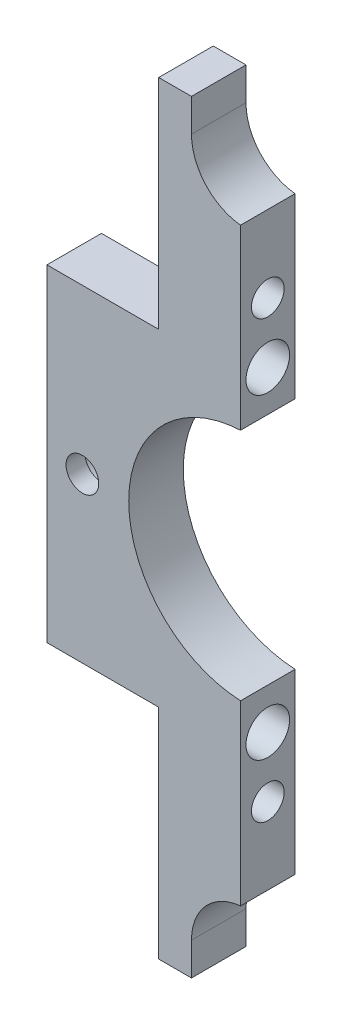
ISO-10303-21;
HEADER;
FILE_DESCRIPTION(('STEP AP214'),'2;1');
FILE_NAME('part.step','',(''),(''),'','','');
FILE_SCHEMA(('AUTOMOTIVE_DESIGN { 1 0 10303 214 1 1 1 1 }'));
ENDSEC;
DATA;
#1=APPLICATION_CONTEXT('core data for automotive mechanical design processes');
#2=APPLICATION_PROTOCOL_DEFINITION('international standard','automotive_design',2000,#1);
#3=PRODUCT_CONTEXT('',#1,'mechanical');
#4=PRODUCT('Part','Part','',(#3));
#5=PRODUCT_RELATED_PRODUCT_CATEGORY('part','',(#4));
#6=PRODUCT_DEFINITION_FORMATION('','',#4);
#7=PRODUCT_DEFINITION_CONTEXT('part definition',#1,'design');
#8=PRODUCT_DEFINITION('design','',#6,#7);
#9=PRODUCT_DEFINITION_SHAPE('','',#8);
#10=(LENGTH_UNIT() NAMED_UNIT(*) SI_UNIT(.MILLI.,.METRE.));
#11=(NAMED_UNIT(*) PLANE_ANGLE_UNIT() SI_UNIT($,.RADIAN.));
#12=(NAMED_UNIT(*) SI_UNIT($,.STERADIAN.) SOLID_ANGLE_UNIT());
#13=UNCERTAINTY_MEASURE_WITH_UNIT(LENGTH_MEASURE(1.E-05),#10,'distance_accuracy_value','');
#14=(GEOMETRIC_REPRESENTATION_CONTEXT(3) GLOBAL_UNCERTAINTY_ASSIGNED_CONTEXT((#13)) GLOBAL_UNIT_ASSIGNED_CONTEXT((#10,
#11,#12)) REPRESENTATION_CONTEXT('',''));
#15=CARTESIAN_POINT('',(0.,0.,0.));
#16=DIRECTION('',(0.,0.,1.));
#17=DIRECTION('',(1.,0.,0.));
#18=AXIS2_PLACEMENT_3D('',#15,#16,#17);
#19=CARTESIAN_POINT('',(6.49999999999995,70.0000000000001,10.));
#20=DIRECTION('',(0.,0.,-1.));
#21=DIRECTION('',(-1.,0.,0.));
#22=AXIS2_PLACEMENT_3D('',#19,#20,#21);
#23=CYLINDRICAL_SURFACE('',#22,3.);
#24=CARTESIAN_POINT('',(6.49999999999995,70.0000000000001,10.));
#25=DIRECTION('',(0.,0.,1.));
#26=DIRECTION('',(1.,0.,0.));
#27=AXIS2_PLACEMENT_3D('',#24,#25,#26);
#28=CIRCLE('',#27,3.);
#29=CARTESIAN_POINT('',(9.49999999999995,70.0000000000001,10.));
#30=VERTEX_POINT('',#29);
#31=EDGE_CURVE('E185',#30,#30,#28,.T.);
#32=ORIENTED_EDGE('',*,*,#31,.T.);
#33=EDGE_LOOP('',(#32));
#34=FACE_BOUND('',#33,.T.);
#35=CARTESIAN_POINT('',(6.49999999999995,70.0000000000001,6.5));
#36=DIRECTION('',(0.,0.,-1.));
#37=DIRECTION('',(-1.,0.,0.));
#38=AXIS2_PLACEMENT_3D('',#35,#36,#37);
#39=CIRCLE('',#38,3.);
#40=CARTESIAN_POINT('',(3.49999999999995,70.0000000000001,6.5));
#41=VERTEX_POINT('',#40);
#42=EDGE_CURVE('E32',#41,#41,#39,.T.);
#43=ORIENTED_EDGE('',*,*,#42,.T.);
#44=EDGE_LOOP('',(#43));
#45=FACE_BOUND('',#44,.T.);
#46=ADVANCED_FACE('F29',(#34,#45),#23,.F.);
#47=CARTESIAN_POINT('',(36.5,134.,10.));
#48=DIRECTION('',(0.,0.,-1.));
#49=DIRECTION('',(-1.,0.,0.));
#50=AXIS2_PLACEMENT_3D('',#47,#48,#49);
#51=CYLINDRICAL_SURFACE('',#50,10.);
#52=CARTESIAN_POINT('',(36.5,134.,0.));
#53=DIRECTION('',(0.,0.,1.));
#54=DIRECTION('',(1.,0.,0.));
#55=AXIS2_PLACEMENT_3D('',#52,#53,#54);
#56=CIRCLE('',#55,10.);
#57=CARTESIAN_POINT('',(26.5,134.,0.));
#58=VERTEX_POINT('',#57);
#59=CARTESIAN_POINT('',(35.5,124.050125628934,0.));
#60=VERTEX_POINT('',#59);
#61=EDGE_CURVE('E140',#58,#60,#56,.T.);
#62=ORIENTED_EDGE('',*,*,#61,.F.);
#63=DIRECTION('',(0.,0.,-1.));
#64=VECTOR('',#63,1.);
#65=CARTESIAN_POINT('',(26.5,134.,10.));
#66=LINE('',#65,#64);
#67=CARTESIAN_POINT('',(26.5,134.,10.));
#68=VERTEX_POINT('',#67);
#69=EDGE_CURVE('E11',#68,#58,#66,.T.);
#70=ORIENTED_EDGE('',*,*,#69,.F.);
#71=CARTESIAN_POINT('',(36.5,134.,10.));
#72=DIRECTION('',(0.,0.,1.));
#73=DIRECTION('',(1.,0.,0.));
#74=AXIS2_PLACEMENT_3D('',#71,#72,#73);
#75=CIRCLE('',#74,10.);
#76=CARTESIAN_POINT('',(35.5,124.050125628934,10.));
#77=VERTEX_POINT('',#76);
#78=EDGE_CURVE('E188',#68,#77,#75,.T.);
#79=ORIENTED_EDGE('',*,*,#78,.T.);
#80=DIRECTION('',(0.,0.,-1.));
#81=VECTOR('',#80,1.);
#82=CARTESIAN_POINT('',(35.5,124.050125628934,10.));
#83=LINE('',#82,#81);
#84=EDGE_CURVE('E44',#77,#60,#83,.T.);
#85=ORIENTED_EDGE('',*,*,#84,.T.);
#86=EDGE_LOOP('',(#62,#70,#79,#85));
#87=FACE_BOUND('',#86,.T.);
#88=ADVANCED_FACE('F141',(#87),#51,.F.);
#89=CARTESIAN_POINT('',(26.5,-59.5960466115753,10.));
#90=DIRECTION('',(1.,0.,0.));
#91=DIRECTION('',(0.,0.,-1.));
#92=AXIS2_PLACEMENT_3D('',#89,#90,#91);
#93=PLANE('',#92);
#94=DIRECTION('',(0.,-1.,0.));
#95=VECTOR('',#94,1.);
#96=CARTESIAN_POINT('',(26.5,-59.5960466115753,0.));
#97=LINE('',#96,#95);
#98=CARTESIAN_POINT('',(26.5,140.,0.));
#99=VERTEX_POINT('',#98);
#100=EDGE_CURVE('E134',#99,#58,#97,.T.);
#101=ORIENTED_EDGE('',*,*,#100,.F.);
#102=DIRECTION('',(0.,0.,-1.));
#103=VECTOR('',#102,1.);
#104=CARTESIAN_POINT('',(26.5,140.,10.));
#105=LINE('',#104,#103);
#106=CARTESIAN_POINT('',(26.5,140.,10.));
#107=VERTEX_POINT('',#106);
#108=EDGE_CURVE('E37',#107,#99,#105,.T.);
#109=ORIENTED_EDGE('',*,*,#108,.F.);
#110=DIRECTION('',(0.,-1.,0.));
#111=VECTOR('',#110,1.);
#112=CARTESIAN_POINT('',(26.5,-59.5960466115753,10.));
#113=LINE('',#112,#111);
#114=EDGE_CURVE('E136',#107,#68,#113,.T.);
#115=ORIENTED_EDGE('',*,*,#114,.T.);
#116=ORIENTED_EDGE('',*,*,#69,.T.);
#117=EDGE_LOOP('',(#101,#109,#115,#116));
#118=FACE_BOUND('',#117,.T.);
#119=ADVANCED_FACE('F132',(#118),#93,.T.);
#120=CARTESIAN_POINT('',(45.,140.,10.));
#121=DIRECTION('',(0.,-1.,0.));
#122=DIRECTION('',(0.,0.,-1.));
#123=AXIS2_PLACEMENT_3D('',#120,#121,#122);
#124=PLANE('',#123);
#125=DIRECTION('',(-1.,0.,0.));
#126=VECTOR('',#125,1.);
#127=CARTESIAN_POINT('',(45.,140.,0.));
#128=LINE('',#127,#126);
#129=CARTESIAN_POINT('',(20.5,140.,0.));
#130=VERTEX_POINT('',#129);
#131=EDGE_CURVE('E149',#99,#130,#128,.T.);
#132=ORIENTED_EDGE('',*,*,#131,.T.);
#133=DIRECTION('',(0.,0.,-1.));
#134=VECTOR('',#133,1.);
#135=CARTESIAN_POINT('',(20.5,140.,10.));
#136=LINE('',#135,#134);
#137=CARTESIAN_POINT('',(20.5,140.,10.));
#138=VERTEX_POINT('',#137);
#139=EDGE_CURVE('E246',#138,#130,#136,.T.);
#140=ORIENTED_EDGE('',*,*,#139,.F.);
#141=DIRECTION('',(-1.,0.,0.));
#142=VECTOR('',#141,1.);
#143=CARTESIAN_POINT('',(45.,140.,10.));
#144=LINE('',#143,#142);
#145=EDGE_CURVE('E191',#107,#138,#144,.T.);
#146=ORIENTED_EDGE('',*,*,#145,.F.);
#147=ORIENTED_EDGE('',*,*,#108,.T.);
#148=EDGE_LOOP('',(#132,#140,#146,#147));
#149=FACE_BOUND('',#148,.T.);
#150=ADVANCED_FACE('F250',(#149),#124,.F.);
#151=CARTESIAN_POINT('',(20.5,-59.5960466115753,10.));
#152=DIRECTION('',(-1.,0.,0.));
#153=DIRECTION('',(0.,0.,1.));
#154=AXIS2_PLACEMENT_3D('',#151,#152,#153);
#155=PLANE('',#154);
#156=CARTESIAN_POINT('',(20.5,110.,5.));
#157=DIRECTION('',(-1.,0.,0.));
#158=DIRECTION('',(0.,0.,1.));
#159=AXIS2_PLACEMENT_3D('',#156,#157,#158);
#160=CIRCLE('',#159,3.);
#161=CARTESIAN_POINT('',(20.5,110.,8.));
#162=VERTEX_POINT('',#161);
#163=EDGE_CURVE('E328',#162,#162,#160,.T.);
#164=ORIENTED_EDGE('',*,*,#163,.F.);
#165=EDGE_LOOP('',(#164));
#166=FACE_BOUND('',#165,.T.);
#167=DIRECTION('',(0.,1.,0.));
#168=VECTOR('',#167,1.);
#169=CARTESIAN_POINT('',(20.5,-59.5960466115753,0.));
#170=LINE('',#169,#168);
#171=CARTESIAN_POINT('',(20.5,100.,0.));
#172=VERTEX_POINT('',#171);
#173=EDGE_CURVE('E151',#172,#130,#170,.T.);
#174=ORIENTED_EDGE('',*,*,#173,.F.);
#175=DIRECTION('',(0.,0.,-1.));
#176=VECTOR('',#175,1.);
#177=CARTESIAN_POINT('',(20.5,100.,10.));
#178=LINE('',#177,#176);
#179=CARTESIAN_POINT('',(20.5,100.,10.));
#180=VERTEX_POINT('',#179);
#181=EDGE_CURVE('E244',#180,#172,#178,.T.);
#182=ORIENTED_EDGE('',*,*,#181,.F.);
#183=DIRECTION('',(0.,1.,0.));
#184=VECTOR('',#183,1.);
#185=CARTESIAN_POINT('',(20.5,-59.5960466115753,10.));
#186=LINE('',#185,#184);
#187=EDGE_CURVE('E193',#180,#138,#186,.T.);
#188=ORIENTED_EDGE('',*,*,#187,.T.);
#189=ORIENTED_EDGE('',*,*,#139,.T.);
#190=EDGE_LOOP('',(#174,#182,#188,#189));
#191=FACE_BOUND('',#190,.T.);
#192=ADVANCED_FACE('F289',(#166,#191),#155,.T.);
#193=CARTESIAN_POINT('',(45.,100.,10.));
#194=DIRECTION('',(0.,1.,0.));
#195=DIRECTION('',(0.,0.,1.));
#196=AXIS2_PLACEMENT_3D('',#193,#194,#195);
#197=PLANE('',#196);
#198=DIRECTION('',(1.,0.,0.));
#199=VECTOR('',#198,1.);
#200=CARTESIAN_POINT('',(45.,100.,0.));
#201=LINE('',#200,#199);
#202=CARTESIAN_POINT('',(0.,100.,0.));
#203=VERTEX_POINT('',#202);
#204=EDGE_CURVE('E156',#203,#172,#201,.T.);
#205=ORIENTED_EDGE('',*,*,#204,.F.);
#206=DIRECTION('',(0.,0.,-1.));
#207=VECTOR('',#206,1.);
#208=CARTESIAN_POINT('',(0.,100.,10.));
#209=LINE('',#208,#207);
#210=CARTESIAN_POINT('',(0.,100.,10.));
#211=VERTEX_POINT('',#210);
#212=EDGE_CURVE('E242',#211,#203,#209,.T.);
#213=ORIENTED_EDGE('',*,*,#212,.F.);
#214=DIRECTION('',(1.,0.,0.));
#215=VECTOR('',#214,1.);
#216=CARTESIAN_POINT('',(45.,100.,10.));
#217=LINE('',#216,#215);
#218=EDGE_CURVE('E196',#211,#180,#217,.T.);
#219=ORIENTED_EDGE('',*,*,#218,.T.);
#220=ORIENTED_EDGE('',*,*,#181,.T.);
#221=EDGE_LOOP('',(#205,#213,#219,#220));
#222=FACE_BOUND('',#221,.T.);
#223=ADVANCED_FACE('F284',(#222),#197,.T.);
#224=CARTESIAN_POINT('',(0.,-59.5960466115753,10.));
#225=DIRECTION('',(1.,0.,0.));
#226=DIRECTION('',(0.,1.,0.));
#227=AXIS2_PLACEMENT_3D('',#224,#225,#226);
#228=PLANE('',#227);
#229=DIRECTION('',(0.,-1.,0.));
#230=VECTOR('',#229,1.);
#231=CARTESIAN_POINT('',(0.,-59.5960466115753,0.));
#232=LINE('',#231,#230);
#233=CARTESIAN_POINT('',(0.,40.,0.));
#234=VERTEX_POINT('',#233);
#235=EDGE_CURVE('E159',#203,#234,#232,.T.);
#236=ORIENTED_EDGE('',*,*,#235,.T.);
#237=DIRECTION('',(0.,0.,-1.));
#238=VECTOR('',#237,1.);
#239=CARTESIAN_POINT('',(0.,40.,10.));
#240=LINE('',#239,#238);
#241=CARTESIAN_POINT('',(0.,40.,10.));
#242=VERTEX_POINT('',#241);
#243=EDGE_CURVE('E239',#242,#234,#240,.T.);
#244=ORIENTED_EDGE('',*,*,#243,.F.);
#245=DIRECTION('',(0.,-1.,0.));
#246=VECTOR('',#245,1.);
#247=CARTESIAN_POINT('',(0.,-59.5960466115753,10.));
#248=LINE('',#247,#246);
#249=EDGE_CURVE('E199',#211,#242,#248,.T.);
#250=ORIENTED_EDGE('',*,*,#249,.F.);
#251=ORIENTED_EDGE('',*,*,#212,.T.);
#252=EDGE_LOOP('',(#236,#244,#250,#251));
#253=FACE_BOUND('',#252,.T.);
#254=ADVANCED_FACE('F290',(#253),#228,.F.);
#255=CARTESIAN_POINT('',(45.0000000000001,39.9999999999999,10.));
#256=DIRECTION('',(0.,1.,0.));
#257=DIRECTION('',(-1.,0.,0.));
#258=AXIS2_PLACEMENT_3D('',#255,#256,#257);
#259=PLANE('',#258);
#260=DIRECTION('',(1.,0.,0.));
#261=VECTOR('',#260,1.);
#262=CARTESIAN_POINT('',(45.0000000000001,39.9999999999999,0.));
#263=LINE('',#262,#261);
#264=CARTESIAN_POINT('',(20.4999999999999,40.,0.));
#265=VERTEX_POINT('',#264);
#266=EDGE_CURVE('E162',#234,#265,#263,.T.);
#267=ORIENTED_EDGE('',*,*,#266,.T.);
#268=DIRECTION('',(0.,0.,-1.));
#269=VECTOR('',#268,1.);
#270=CARTESIAN_POINT('',(20.4999999999999,40.,10.));
#271=LINE('',#270,#269);
#272=CARTESIAN_POINT('',(20.4999999999999,40.,10.));
#273=VERTEX_POINT('',#272);
#274=EDGE_CURVE('E236',#273,#265,#271,.T.);
#275=ORIENTED_EDGE('',*,*,#274,.F.);
#276=DIRECTION('',(1.,0.,0.));
#277=VECTOR('',#276,1.);
#278=CARTESIAN_POINT('',(45.0000000000001,39.9999999999999,10.));
#279=LINE('',#278,#277);
#280=EDGE_CURVE('E202',#242,#273,#279,.T.);
#281=ORIENTED_EDGE('',*,*,#280,.F.);
#282=ORIENTED_EDGE('',*,*,#243,.T.);
#283=EDGE_LOOP('',(#267,#275,#281,#282));
#284=FACE_BOUND('',#283,.T.);
#285=ADVANCED_FACE('F278',(#284),#259,.F.);
#286=CARTESIAN_POINT('',(20.4999999999999,-59.5960466115753,10.));
#287=DIRECTION('',(1.,0.,0.));
#288=DIRECTION('',(0.,1.,0.));
#289=AXIS2_PLACEMENT_3D('',#286,#287,#288);
#290=PLANE('',#289);
#291=CARTESIAN_POINT('',(20.4999999999999,30.,5.));
#292=DIRECTION('',(-1.,0.,0.));
#293=DIRECTION('',(0.,-1.,0.));
#294=AXIS2_PLACEMENT_3D('',#291,#292,#293);
#295=CIRCLE('',#294,3.);
#296=CARTESIAN_POINT('',(20.4999999999999,27.,5.));
#297=VERTEX_POINT('',#296);
#298=EDGE_CURVE('E322',#297,#297,#295,.T.);
#299=ORIENTED_EDGE('',*,*,#298,.F.);
#300=EDGE_LOOP('',(#299));
#301=FACE_BOUND('',#300,.T.);
#302=DIRECTION('',(0.,-1.,0.));
#303=VECTOR('',#302,1.);
#304=CARTESIAN_POINT('',(20.4999999999999,-59.5960466115753,0.));
#305=LINE('',#304,#303);
#306=CARTESIAN_POINT('',(20.4999999999999,0.,0.));
#307=VERTEX_POINT('',#306);
#308=EDGE_CURVE('E165',#265,#307,#305,.T.);
#309=ORIENTED_EDGE('',*,*,#308,.T.);
#310=DIRECTION('',(0.,0.,-1.));
#311=VECTOR('',#310,1.);
#312=CARTESIAN_POINT('',(20.4999999999999,0.,10.));
#313=LINE('',#312,#311);
#314=CARTESIAN_POINT('',(20.4999999999999,0.,10.));
#315=VERTEX_POINT('',#314);
#316=EDGE_CURVE('E233',#315,#307,#313,.T.);
#317=ORIENTED_EDGE('',*,*,#316,.F.);
#318=DIRECTION('',(0.,-1.,0.));
#319=VECTOR('',#318,1.);
#320=CARTESIAN_POINT('',(20.4999999999999,-59.5960466115753,10.));
#321=LINE('',#320,#319);
#322=EDGE_CURVE('E205',#273,#315,#321,.T.);
#323=ORIENTED_EDGE('',*,*,#322,.F.);
#324=ORIENTED_EDGE('',*,*,#274,.T.);
#325=EDGE_LOOP('',(#309,#317,#323,#324));
#326=FACE_BOUND('',#325,.T.);
#327=ADVANCED_FACE('F275',(#301,#326),#290,.F.);
#328=CARTESIAN_POINT('',(44.9999999999994,2.28983498828939E-13,10.));
#329=DIRECTION('',(0.,1.,0.));
#330=DIRECTION('',(-1.,0.,0.));
#331=AXIS2_PLACEMENT_3D('',#328,#329,#330);
#332=PLANE('',#331);
#333=DIRECTION('',(1.,0.,0.));
#334=VECTOR('',#333,1.);
#335=CARTESIAN_POINT('',(44.9999999999994,2.28983498828939E-13,0.));
#336=LINE('',#335,#334);
#337=CARTESIAN_POINT('',(26.4999999999999,0.,0.));
#338=VERTEX_POINT('',#337);
#339=EDGE_CURVE('E168',#307,#338,#336,.T.);
#340=ORIENTED_EDGE('',*,*,#339,.T.);
#341=DIRECTION('',(0.,0.,-1.));
#342=VECTOR('',#341,1.);
#343=CARTESIAN_POINT('',(26.4999999999999,0.,10.));
#344=LINE('',#343,#342);
#345=CARTESIAN_POINT('',(26.4999999999999,0.,10.));
#346=VERTEX_POINT('',#345);
#347=EDGE_CURVE('E231',#346,#338,#344,.T.);
#348=ORIENTED_EDGE('',*,*,#347,.F.);
#349=DIRECTION('',(1.,0.,0.));
#350=VECTOR('',#349,1.);
#351=CARTESIAN_POINT('',(44.9999999999994,2.28983498828939E-13,10.));
#352=LINE('',#351,#350);
#353=EDGE_CURVE('E208',#315,#346,#352,.T.);
#354=ORIENTED_EDGE('',*,*,#353,.F.);
#355=ORIENTED_EDGE('',*,*,#316,.T.);
#356=EDGE_LOOP('',(#340,#348,#354,#355));
#357=FACE_BOUND('',#356,.T.);
#358=ADVANCED_FACE('F273',(#357),#332,.F.);
#359=CARTESIAN_POINT('',(26.4999999999999,-59.5960466115753,10.));
#360=DIRECTION('',(1.,0.,0.));
#361=DIRECTION('',(0.,0.,-1.));
#362=AXIS2_PLACEMENT_3D('',#359,#360,#361);
#363=PLANE('',#362);
#364=DIRECTION('',(0.,-1.,0.));
#365=VECTOR('',#364,1.);
#366=CARTESIAN_POINT('',(26.4999999999999,-59.5960466115753,0.));
#367=LINE('',#366,#365);
#368=CARTESIAN_POINT('',(26.4999999999999,6.00000000000005,0.));
#369=VERTEX_POINT('',#368);
#370=EDGE_CURVE('E171',#369,#338,#367,.T.);
#371=ORIENTED_EDGE('',*,*,#370,.F.);
#372=DIRECTION('',(0.,0.,-1.));
#373=VECTOR('',#372,1.);
#374=CARTESIAN_POINT('',(26.4999999999999,6.00000000000005,10.));
#375=LINE('',#374,#373);
#376=CARTESIAN_POINT('',(26.4999999999999,6.00000000000005,10.));
#377=VERTEX_POINT('',#376);
#378=EDGE_CURVE('E229',#377,#369,#375,.T.);
#379=ORIENTED_EDGE('',*,*,#378,.F.);
#380=DIRECTION('',(0.,-1.,0.));
#381=VECTOR('',#380,1.);
#382=CARTESIAN_POINT('',(26.4999999999999,-59.5960466115753,10.));
#383=LINE('',#382,#381);
#384=EDGE_CURVE('E210',#377,#346,#383,.T.);
#385=ORIENTED_EDGE('',*,*,#384,.T.);
#386=ORIENTED_EDGE('',*,*,#347,.T.);
#387=EDGE_LOOP('',(#371,#379,#385,#386));
#388=FACE_BOUND('',#387,.T.);
#389=ADVANCED_FACE('F269',(#388),#363,.T.);
#390=CARTESIAN_POINT('',(36.5,6.00000000000006,10.));
#391=DIRECTION('',(0.,0.,-1.));
#392=DIRECTION('',(-1.,0.,0.));
#393=AXIS2_PLACEMENT_3D('',#390,#391,#392);
#394=CYLINDRICAL_SURFACE('',#393,10.);
#395=CARTESIAN_POINT('',(36.5,6.00000000000006,0.));
#396=DIRECTION('',(0.,0.,1.));
#397=DIRECTION('',(1.,0.,0.));
#398=AXIS2_PLACEMENT_3D('',#395,#396,#397);
#399=CIRCLE('',#398,10.);
#400=CARTESIAN_POINT('',(35.5,15.9498743710663,0.));
#401=VERTEX_POINT('',#400);
#402=EDGE_CURVE('E174',#401,#369,#399,.T.);
#403=ORIENTED_EDGE('',*,*,#402,.F.);
#404=DIRECTION('',(0.,0.,-1.));
#405=VECTOR('',#404,1.);
#406=CARTESIAN_POINT('',(35.5,15.9498743710663,10.));
#407=LINE('',#406,#405);
#408=CARTESIAN_POINT('',(35.5,15.9498743710663,10.));
#409=VERTEX_POINT('',#408);
#410=EDGE_CURVE('E227',#409,#401,#407,.T.);
#411=ORIENTED_EDGE('',*,*,#410,.F.);
#412=CARTESIAN_POINT('',(36.5,6.00000000000006,10.));
#413=DIRECTION('',(0.,0.,1.));
#414=DIRECTION('',(1.,0.,0.));
#415=AXIS2_PLACEMENT_3D('',#412,#413,#414);
#416=CIRCLE('',#415,10.);
#417=EDGE_CURVE('E213',#409,#377,#416,.T.);
#418=ORIENTED_EDGE('',*,*,#417,.T.);
#419=ORIENTED_EDGE('',*,*,#378,.T.);
#420=EDGE_LOOP('',(#403,#411,#418,#419));
#421=FACE_BOUND('',#420,.T.);
#422=ADVANCED_FACE('F265',(#421),#394,.F.);
#423=CARTESIAN_POINT('',(35.5,-59.5960466115753,10.));
#424=DIRECTION('',(1.,0.,0.));
#425=DIRECTION('',(0.,0.,-1.));
#426=AXIS2_PLACEMENT_3D('',#423,#424,#425);
#427=PLANE('',#426);
#428=CARTESIAN_POINT('',(35.5,41.0232684050855,4.99999999999999));
#429=DIRECTION('',(1.,0.,0.));
#430=DIRECTION('',(0.,0.,-1.));
#431=AXIS2_PLACEMENT_3D('',#428,#429,#430);
#432=CIRCLE('',#431,4.);
#433=CARTESIAN_POINT('',(35.5,41.0232684050855,0.999999999999993));
#434=VERTEX_POINT('',#433);
#435=EDGE_CURVE('E337',#434,#434,#432,.T.);
#436=ORIENTED_EDGE('',*,*,#435,.F.);
#437=EDGE_LOOP('',(#436));
#438=FACE_BOUND('',#437,.T.);
#439=CARTESIAN_POINT('',(35.4999999999999,30.,5.));
#440=DIRECTION('',(-1.,0.,0.));
#441=DIRECTION('',(0.,-1.,0.));
#442=AXIS2_PLACEMENT_3D('',#439,#440,#441);
#443=CIRCLE('',#442,3.);
#444=CARTESIAN_POINT('',(35.4999999999999,27.,5.));
#445=VERTEX_POINT('',#444);
#446=EDGE_CURVE('E317',#445,#445,#443,.T.);
#447=ORIENTED_EDGE('',*,*,#446,.T.);
#448=EDGE_LOOP('',(#447));
#449=FACE_BOUND('',#448,.T.);
#450=DIRECTION('',(0.,-1.,0.));
#451=VECTOR('',#450,1.);
#452=CARTESIAN_POINT('',(35.5,-59.5960466115753,0.));
#453=LINE('',#452,#451);
#454=CARTESIAN_POINT('',(35.5,48.5232684050855,0.));
#455=VERTEX_POINT('',#454);
#456=EDGE_CURVE('E177',#455,#401,#453,.T.);
#457=ORIENTED_EDGE('',*,*,#456,.F.);
#458=DIRECTION('',(0.,0.,-1.));
#459=VECTOR('',#458,1.);
#460=CARTESIAN_POINT('',(35.5,48.5232684050855,10.));
#461=LINE('',#460,#459);
#462=CARTESIAN_POINT('',(35.5,48.5232684050855,10.));
#463=VERTEX_POINT('',#462);
#464=EDGE_CURVE('E225',#463,#455,#461,.T.);
#465=ORIENTED_EDGE('',*,*,#464,.F.);
#466=DIRECTION('',(0.,-1.,0.));
#467=VECTOR('',#466,1.);
#468=CARTESIAN_POINT('',(35.5,-59.5960466115753,10.));
#469=LINE('',#468,#467);
#470=EDGE_CURVE('E216',#463,#409,#469,.T.);
#471=ORIENTED_EDGE('',*,*,#470,.T.);
#472=ORIENTED_EDGE('',*,*,#410,.T.);
#473=EDGE_LOOP('',(#457,#465,#471,#472));
#474=FACE_BOUND('',#473,.T.);
#475=ADVANCED_FACE('F262',(#438,#449,#474),#427,.T.);
#476=CARTESIAN_POINT('',(36.5,70.,10.));
#477=DIRECTION('',(0.,0.,-1.));
#478=DIRECTION('',(-1.,0.,0.));
#479=AXIS2_PLACEMENT_3D('',#476,#477,#478);
#480=CYLINDRICAL_SURFACE('',#479,21.5);
#481=CARTESIAN_POINT('',(36.5,70.,0.));
#482=DIRECTION('',(0.,0.,1.));
#483=DIRECTION('',(1.,0.,0.));
#484=AXIS2_PLACEMENT_3D('',#481,#482,#483);
#485=CIRCLE('',#484,21.5);
#486=CARTESIAN_POINT('',(35.5,91.4767315949146,0.));
#487=VERTEX_POINT('',#486);
#488=EDGE_CURVE('E180',#487,#455,#485,.T.);
#489=ORIENTED_EDGE('',*,*,#488,.F.);
#490=DIRECTION('',(0.,0.,-1.));
#491=VECTOR('',#490,1.);
#492=CARTESIAN_POINT('',(35.5,91.4767315949146,10.));
#493=LINE('',#492,#491);
#494=CARTESIAN_POINT('',(35.5,91.4767315949146,10.));
#495=VERTEX_POINT('',#494);
#496=EDGE_CURVE('E52',#495,#487,#493,.T.);
#497=ORIENTED_EDGE('',*,*,#496,.F.);
#498=CARTESIAN_POINT('',(36.5,70.,10.));
#499=DIRECTION('',(0.,0.,1.));
#500=DIRECTION('',(1.,0.,0.));
#501=AXIS2_PLACEMENT_3D('',#498,#499,#500);
#502=CIRCLE('',#501,21.5);
#503=EDGE_CURVE('E219',#495,#463,#502,.T.);
#504=ORIENTED_EDGE('',*,*,#503,.T.);
#505=ORIENTED_EDGE('',*,*,#464,.T.);
#506=EDGE_LOOP('',(#489,#497,#504,#505));
#507=FACE_BOUND('',#506,.T.);
#508=ADVANCED_FACE('F258',(#507),#480,.F.);
#509=CARTESIAN_POINT('',(35.5,-59.5960466115753,10.));
#510=DIRECTION('',(1.,0.,0.));
#511=DIRECTION('',(0.,0.,-1.));
#512=AXIS2_PLACEMENT_3D('',#509,#510,#511);
#513=PLANE('',#512);
#514=CARTESIAN_POINT('',(35.5,98.9767315949146,5.));
#515=DIRECTION('',(1.,0.,0.));
#516=DIRECTION('',(0.,0.,-1.));
#517=AXIS2_PLACEMENT_3D('',#514,#515,#516);
#518=CIRCLE('',#517,4.);
#519=CARTESIAN_POINT('',(35.5,98.9767315949146,0.999999999999999));
#520=VERTEX_POINT('',#519);
#521=EDGE_CURVE('E334',#520,#520,#518,.T.);
#522=ORIENTED_EDGE('',*,*,#521,.F.);
#523=EDGE_LOOP('',(#522));
#524=FACE_BOUND('',#523,.T.);
#525=CARTESIAN_POINT('',(35.5,110.,5.));
#526=DIRECTION('',(-1.,0.,0.));
#527=DIRECTION('',(0.,0.,1.));
#528=AXIS2_PLACEMENT_3D('',#525,#526,#527);
#529=CIRCLE('',#528,3.);
#530=CARTESIAN_POINT('',(35.5,110.,8.));
#531=VERTEX_POINT('',#530);
#532=EDGE_CURVE('E325',#531,#531,#529,.T.);
#533=ORIENTED_EDGE('',*,*,#532,.T.);
#534=EDGE_LOOP('',(#533));
#535=FACE_BOUND('',#534,.T.);
#536=DIRECTION('',(0.,-1.,0.));
#537=VECTOR('',#536,1.);
#538=CARTESIAN_POINT('',(35.5,-59.5960466115753,0.));
#539=LINE('',#538,#537);
#540=EDGE_CURVE('E183',#60,#487,#539,.T.);
#541=ORIENTED_EDGE('',*,*,#540,.F.);
#542=ORIENTED_EDGE('',*,*,#84,.F.);
#543=DIRECTION('',(0.,-1.,0.));
#544=VECTOR('',#543,1.);
#545=CARTESIAN_POINT('',(35.5,-59.5960466115753,10.));
#546=LINE('',#545,#544);
#547=EDGE_CURVE('E221',#77,#495,#546,.T.);
#548=ORIENTED_EDGE('',*,*,#547,.T.);
#549=ORIENTED_EDGE('',*,*,#496,.T.);
#550=EDGE_LOOP('',(#541,#542,#548,#549));
#551=FACE_BOUND('',#550,.T.);
#552=ADVANCED_FACE('F257',(#524,#535,#551),#513,.T.);
#553=CARTESIAN_POINT('',(45.,-59.5960466115753,10.));
#554=DIRECTION('',(0.,0.,1.));
#555=DIRECTION('',(1.,0.,0.));
#556=AXIS2_PLACEMENT_3D('',#553,#554,#555);
#557=PLANE('',#556);
#558=ORIENTED_EDGE('',*,*,#31,.F.);
#559=EDGE_LOOP('',(#558));
#560=FACE_BOUND('',#559,.T.);
#561=ORIENTED_EDGE('',*,*,#78,.F.);
#562=ORIENTED_EDGE('',*,*,#114,.F.);
#563=ORIENTED_EDGE('',*,*,#145,.T.);
#564=ORIENTED_EDGE('',*,*,#187,.F.);
#565=ORIENTED_EDGE('',*,*,#218,.F.);
#566=ORIENTED_EDGE('',*,*,#249,.T.);
#567=ORIENTED_EDGE('',*,*,#280,.T.);
#568=ORIENTED_EDGE('',*,*,#322,.T.);
#569=ORIENTED_EDGE('',*,*,#353,.T.);
#570=ORIENTED_EDGE('',*,*,#384,.F.);
#571=ORIENTED_EDGE('',*,*,#417,.F.);
#572=ORIENTED_EDGE('',*,*,#470,.F.);
#573=ORIENTED_EDGE('',*,*,#503,.F.);
#574=ORIENTED_EDGE('',*,*,#547,.F.);
#575=EDGE_LOOP('',(#561,#562,#563,#564,#565,#566,#567,#568,#569,#570,#571,#572,#573,#574));
#576=FACE_BOUND('',#575,.T.);
#577=ADVANCED_FACE('F254',(#560,#576),#557,.T.);
#578=CARTESIAN_POINT('',(45.,-59.5960466115753,0.));
#579=DIRECTION('',(0.,0.,1.));
#580=DIRECTION('',(1.,0.,0.));
#581=AXIS2_PLACEMENT_3D('',#578,#579,#580);
#582=PLANE('',#581);
#583=CARTESIAN_POINT('',(6.49999999999995,70.0000000000001,0.));
#584=DIRECTION('',(0.,0.,-1.));
#585=DIRECTION('',(-1.,0.,0.));
#586=AXIS2_PLACEMENT_3D('',#583,#584,#585);
#587=CIRCLE('',#586,5.);
#588=CARTESIAN_POINT('',(1.49999999999995,70.0000000000001,0.));
#589=VERTEX_POINT('',#588);
#590=EDGE_CURVE('E313',#589,#589,#587,.T.);
#591=ORIENTED_EDGE('',*,*,#590,.F.);
#592=EDGE_LOOP('',(#591));
#593=FACE_BOUND('',#592,.T.);
#594=ORIENTED_EDGE('',*,*,#61,.T.);
#595=ORIENTED_EDGE('',*,*,#540,.T.);
#596=ORIENTED_EDGE('',*,*,#488,.T.);
#597=ORIENTED_EDGE('',*,*,#456,.T.);
#598=ORIENTED_EDGE('',*,*,#402,.T.);
#599=ORIENTED_EDGE('',*,*,#370,.T.);
#600=ORIENTED_EDGE('',*,*,#339,.F.);
#601=ORIENTED_EDGE('',*,*,#308,.F.);
#602=ORIENTED_EDGE('',*,*,#266,.F.);
#603=ORIENTED_EDGE('',*,*,#235,.F.);
#604=ORIENTED_EDGE('',*,*,#204,.T.);
#605=ORIENTED_EDGE('',*,*,#173,.T.);
#606=ORIENTED_EDGE('',*,*,#131,.F.);
#607=ORIENTED_EDGE('',*,*,#100,.T.);
#608=EDGE_LOOP('',(#594,#595,#596,#597,#598,#599,#600,#601,#602,#603,#604,#605,#606,#607));
#609=FACE_BOUND('',#608,.T.);
#610=ADVANCED_FACE('F146',(#593,#609),#582,.F.);
#611=CARTESIAN_POINT('',(6.49999999999995,70.0000000000001,6.5));
#612=DIRECTION('',(0.,0.,-1.));
#613=DIRECTION('',(-1.,0.,0.));
#614=AXIS2_PLACEMENT_3D('',#611,#612,#613);
#615=CYLINDRICAL_SURFACE('',#614,5.);
#616=CARTESIAN_POINT('',(6.49999999999995,70.0000000000001,6.5));
#617=DIRECTION('',(0.,0.,-1.));
#618=DIRECTION('',(-1.,0.,0.));
#619=AXIS2_PLACEMENT_3D('',#616,#617,#618);
#620=CIRCLE('',#619,5.);
#621=CARTESIAN_POINT('',(1.49999999999995,70.0000000000001,6.5));
#622=VERTEX_POINT('',#621);
#623=EDGE_CURVE('E311',#622,#622,#620,.T.);
#624=ORIENTED_EDGE('',*,*,#623,.F.);
#625=EDGE_LOOP('',(#624));
#626=FACE_BOUND('',#625,.T.);
#627=ORIENTED_EDGE('',*,*,#590,.T.);
#628=EDGE_LOOP('',(#627));
#629=FACE_BOUND('',#628,.T.);
#630=ADVANCED_FACE('F386',(#626,#629),#615,.F.);
#631=CARTESIAN_POINT('',(6.49999999999995,70.0000000000001,6.5));
#632=DIRECTION('',(0.,0.,-1.));
#633=DIRECTION('',(-1.,0.,0.));
#634=AXIS2_PLACEMENT_3D('',#631,#632,#633);
#635=PLANE('',#634);
#636=ORIENTED_EDGE('',*,*,#42,.F.);
#637=EDGE_LOOP('',(#636));
#638=FACE_BOUND('',#637,.T.);
#639=ORIENTED_EDGE('',*,*,#623,.T.);
#640=EDGE_LOOP('',(#639));
#641=FACE_BOUND('',#640,.T.);
#642=ADVANCED_FACE('F362',(#638,#641),#635,.T.);
#643=CARTESIAN_POINT('',(35.4999999999999,30.,5.));
#644=DIRECTION('',(-1.,0.,0.));
#645=DIRECTION('',(0.,-1.,0.));
#646=AXIS2_PLACEMENT_3D('',#643,#644,#645);
#647=CYLINDRICAL_SURFACE('',#646,3.);
#648=ORIENTED_EDGE('',*,*,#446,.F.);
#649=EDGE_LOOP('',(#648));
#650=FACE_BOUND('',#649,.T.);
#651=ORIENTED_EDGE('',*,*,#298,.T.);
#652=EDGE_LOOP('',(#651));
#653=FACE_BOUND('',#652,.T.);
#654=ADVANCED_FACE('F358',(#650,#653),#647,.F.);
#655=CARTESIAN_POINT('',(35.5,110.,5.));
#656=DIRECTION('',(-1.,0.,0.));
#657=DIRECTION('',(0.,0.,1.));
#658=AXIS2_PLACEMENT_3D('',#655,#656,#657);
#659=CYLINDRICAL_SURFACE('',#658,3.);
#660=ORIENTED_EDGE('',*,*,#532,.F.);
#661=EDGE_LOOP('',(#660));
#662=FACE_BOUND('',#661,.T.);
#663=ORIENTED_EDGE('',*,*,#163,.T.);
#664=EDGE_LOOP('',(#663));
#665=FACE_BOUND('',#664,.T.);
#666=ADVANCED_FACE('F361',(#662,#665),#659,.F.);
#667=CARTESIAN_POINT('',(25.5,98.9767315949146,5.));
#668=DIRECTION('',(1.,0.,0.));
#669=DIRECTION('',(0.,0.,-1.));
#670=AXIS2_PLACEMENT_3D('',#667,#668,#669);
#671=CYLINDRICAL_SURFACE('',#670,4.);
#672=CARTESIAN_POINT('',(25.5,98.9767315949146,5.));
#673=DIRECTION('',(1.,0.,0.));
#674=DIRECTION('',(0.,0.,-1.));
#675=AXIS2_PLACEMENT_3D('',#672,#673,#674);
#676=CIRCLE('',#675,4.);
#677=CARTESIAN_POINT('',(25.5,98.9767315949146,0.999999999999999));
#678=VERTEX_POINT('',#677);
#679=EDGE_CURVE('E331',#678,#678,#676,.T.);
#680=ORIENTED_EDGE('',*,*,#679,.F.);
#681=EDGE_LOOP('',(#680));
#682=FACE_BOUND('',#681,.T.);
#683=ORIENTED_EDGE('',*,*,#521,.T.);
#684=EDGE_LOOP('',(#683));
#685=FACE_BOUND('',#684,.T.);
#686=ADVANCED_FACE('F394',(#682,#685),#671,.F.);
#687=CARTESIAN_POINT('',(25.5,98.9767315949146,5.));
#688=DIRECTION('',(1.,0.,0.));
#689=DIRECTION('',(0.,0.,-1.));
#690=AXIS2_PLACEMENT_3D('',#687,#688,#689);
#691=PLANE('',#690);
#692=ORIENTED_EDGE('',*,*,#679,.T.);
#693=EDGE_LOOP('',(#692));
#694=FACE_BOUND('',#693,.T.);
#695=ADVANCED_FACE('F349',(#694),#691,.T.);
#696=CARTESIAN_POINT('',(25.5,41.0232684050855,4.99999999999999));
#697=DIRECTION('',(1.,0.,0.));
#698=DIRECTION('',(0.,0.,-1.));
#699=AXIS2_PLACEMENT_3D('',#696,#697,#698);
#700=CYLINDRICAL_SURFACE('',#699,4.);
#701=CARTESIAN_POINT('',(25.5,41.0232684050855,4.99999999999999));
#702=DIRECTION('',(1.,0.,0.));
#703=DIRECTION('',(0.,0.,-1.));
#704=AXIS2_PLACEMENT_3D('',#701,#702,#703);
#705=CIRCLE('',#704,4.);
#706=CARTESIAN_POINT('',(25.5,41.0232684050855,0.999999999999993));
#707=VERTEX_POINT('',#706);
#708=EDGE_CURVE('E340',#707,#707,#705,.T.);
#709=ORIENTED_EDGE('',*,*,#708,.F.);
#710=EDGE_LOOP('',(#709));
#711=FACE_BOUND('',#710,.T.);
#712=ORIENTED_EDGE('',*,*,#435,.T.);
#713=EDGE_LOOP('',(#712));
#714=FACE_BOUND('',#713,.T.);
#715=ADVANCED_FACE('F346',(#711,#714),#700,.F.);
#716=CARTESIAN_POINT('',(25.5,41.0232684050855,4.99999999999999));
#717=DIRECTION('',(1.,0.,0.));
#718=DIRECTION('',(0.,0.,-1.));
#719=AXIS2_PLACEMENT_3D('',#716,#717,#718);
#720=PLANE('',#719);
#721=ORIENTED_EDGE('',*,*,#708,.T.);
#722=EDGE_LOOP('',(#721));
#723=FACE_BOUND('',#722,.T.);
#724=ADVANCED_FACE('F344',(#723),#720,.T.);
#725=CLOSED_SHELL('',(#46,#88,#119,#150,#192,#223,#254,#285,#327,#358,#389,#422,#475,#508,#552,
#577,#610,#630,#642,#654,#666,#686,#695,#715,#724));
#726=MANIFOLD_SOLID_BREP('B2',#725);
#727=ADVANCED_BREP_SHAPE_REPRESENTATION('',(#18,#726),#14);
#728=SHAPE_DEFINITION_REPRESENTATION(#9,#727);
ENDSEC;
END-ISO-10303-21;
